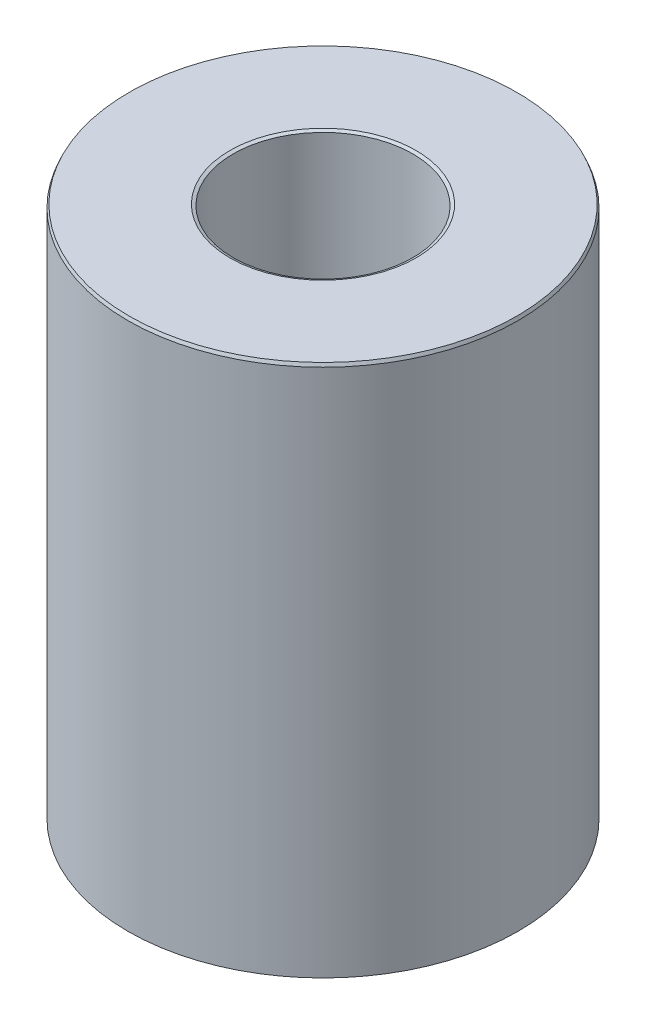
ISO-10303-21;
HEADER;
FILE_DESCRIPTION(('STEP AP214'),'2;1');
FILE_NAME('part.step','',(''),(''),'','','');
FILE_SCHEMA(('AUTOMOTIVE_DESIGN { 1 0 10303 214 1 1 1 1 }'));
ENDSEC;
DATA;
#1=APPLICATION_CONTEXT('core data for automotive mechanical design processes');
#2=APPLICATION_PROTOCOL_DEFINITION('international standard','automotive_design',2000,#1);
#3=PRODUCT_CONTEXT('',#1,'mechanical');
#4=PRODUCT('Part','Part','',(#3));
#5=PRODUCT_RELATED_PRODUCT_CATEGORY('part','',(#4));
#6=PRODUCT_DEFINITION_FORMATION('','',#4);
#7=PRODUCT_DEFINITION_CONTEXT('part definition',#1,'design');
#8=PRODUCT_DEFINITION('design','',#6,#7);
#9=PRODUCT_DEFINITION_SHAPE('','',#8);
#10=(LENGTH_UNIT() NAMED_UNIT(*) SI_UNIT(.MILLI.,.METRE.));
#11=(NAMED_UNIT(*) PLANE_ANGLE_UNIT() SI_UNIT($,.RADIAN.));
#12=(NAMED_UNIT(*) SI_UNIT($,.STERADIAN.) SOLID_ANGLE_UNIT());
#13=UNCERTAINTY_MEASURE_WITH_UNIT(LENGTH_MEASURE(1.E-05),#10,'distance_accuracy_value','');
#14=(GEOMETRIC_REPRESENTATION_CONTEXT(3) GLOBAL_UNCERTAINTY_ASSIGNED_CONTEXT((#13)) GLOBAL_UNIT_ASSIGNED_CONTEXT((#10,
#11,#12)) REPRESENTATION_CONTEXT('',''));
#15=CARTESIAN_POINT('',(0.,0.,0.));
#16=DIRECTION('',(0.,0.,1.));
#17=DIRECTION('',(1.,0.,0.));
#18=AXIS2_PLACEMENT_3D('',#15,#16,#17);
#19=CARTESIAN_POINT('',(0.,109.313836676335,0.));
#20=DIRECTION('',(0.,-1.,0.));
#21=DIRECTION('',(0.,0.,-1.));
#22=AXIS2_PLACEMENT_3D('',#19,#20,#21);
#23=CYLINDRICAL_SURFACE('',#22,40.);
#24=CARTESIAN_POINT('',(0.,0.276940418841298,0.));
#25=DIRECTION('',(0.,1.,0.));
#26=DIRECTION('',(0.,0.,1.));
#27=AXIS2_PLACEMENT_3D('',#24,#25,#26);
#28=CIRCLE('',#27,40.);
#29=CARTESIAN_POINT('',(0.,0.276940418841298,40.));
#30=VERTEX_POINT('',#29);
#31=EDGE_CURVE('E10',#30,#30,#28,.T.);
#32=ORIENTED_EDGE('',*,*,#31,.T.);
#33=EDGE_LOOP('',(#32));
#34=FACE_BOUND('',#33,.T.);
#35=CARTESIAN_POINT('',(0.,108.660381924123,0.));
#36=DIRECTION('',(0.,1.,0.));
#37=DIRECTION('',(0.,0.,1.));
#38=AXIS2_PLACEMENT_3D('',#35,#36,#37);
#39=CIRCLE('',#38,40.);
#40=CARTESIAN_POINT('',(0.,108.660381924123,40.));
#41=VERTEX_POINT('',#40);
#42=EDGE_CURVE('E50',#41,#41,#39,.F.);
#43=ORIENTED_EDGE('',*,*,#42,.T.);
#44=EDGE_LOOP('',(#43));
#45=FACE_BOUND('',#44,.T.);
#46=ADVANCED_FACE('F39',(#34,#45),#23,.T.);
#47=CARTESIAN_POINT('',(0.,109.313836676335,0.));
#48=DIRECTION('',(0.,1.,0.));
#49=DIRECTION('',(0.,0.,1.));
#50=AXIS2_PLACEMENT_3D('',#47,#48,#49);
#51=PLANE('',#50);
#52=CARTESIAN_POINT('',(0.,109.313836676335,0.));
#53=DIRECTION('',(0.,1.,0.));
#54=DIRECTION('',(0.,0.,1.));
#55=AXIS2_PLACEMENT_3D('',#52,#53,#54);
#56=CIRCLE('',#55,19.0755093507502);
#57=CARTESIAN_POINT('',(0.,109.313836676335,19.0755093507502));
#58=VERTEX_POINT('',#57);
#59=EDGE_CURVE('E58',#58,#58,#56,.F.);
#60=ORIENTED_EDGE('',*,*,#59,.T.);
#61=EDGE_LOOP('',(#60));
#62=FACE_BOUND('',#61,.T.);
#63=CARTESIAN_POINT('',(0.,109.313836676335,0.));
#64=DIRECTION('',(0.,1.,0.));
#65=DIRECTION('',(0.,0.,1.));
#66=AXIS2_PLACEMENT_3D('',#63,#64,#65);
#67=CIRCLE('',#66,39.7230595811587);
#68=CARTESIAN_POINT('',(0.,109.313836676335,39.7230595811587));
#69=VERTEX_POINT('',#68);
#70=EDGE_CURVE('E61',#69,#69,#67,.T.);
#71=ORIENTED_EDGE('',*,*,#70,.T.);
#72=EDGE_LOOP('',(#71));
#73=FACE_BOUND('',#72,.T.);
#74=ADVANCED_FACE('F88',(#62,#73),#51,.T.);
#75=CARTESIAN_POINT('',(0.,0.,0.));
#76=DIRECTION('',(0.,1.,0.));
#77=DIRECTION('',(0.,0.,1.));
#78=AXIS2_PLACEMENT_3D('',#75,#76,#77);
#79=PLANE('',#78);
#80=CARTESIAN_POINT('',(0.,0.,0.));
#81=DIRECTION('',(0.,1.,0.));
#82=DIRECTION('',(0.,0.,1.));
#83=AXIS2_PLACEMENT_3D('',#80,#81,#82);
#84=CIRCLE('',#83,18.69899501738);
#85=CARTESIAN_POINT('',(0.,0.,18.69899501738));
#86=VERTEX_POINT('',#85);
#87=EDGE_CURVE('E51',#86,#86,#84,.T.);
#88=ORIENTED_EDGE('',*,*,#87,.T.);
#89=EDGE_LOOP('',(#88));
#90=FACE_BOUND('',#89,.T.);
#91=CARTESIAN_POINT('',(0.,0.,0.));
#92=DIRECTION('',(0.,1.,0.));
#93=DIRECTION('',(0.,0.,1.));
#94=AXIS2_PLACEMENT_3D('',#91,#92,#93);
#95=CIRCLE('',#94,39.3465452477884);
#96=CARTESIAN_POINT('',(0.,0.,39.3465452477884));
#97=VERTEX_POINT('',#96);
#98=EDGE_CURVE('E54',#97,#97,#95,.F.);
#99=ORIENTED_EDGE('',*,*,#98,.T.);
#100=EDGE_LOOP('',(#99));
#101=FACE_BOUND('',#100,.T.);
#102=ADVANCED_FACE('F83',(#90,#101),#79,.F.);
#103=CARTESIAN_POINT('',(0.,109.313836676335,0.));
#104=DIRECTION('',(0.,-1.,0.));
#105=DIRECTION('',(0.,0.,-1.));
#106=AXIS2_PLACEMENT_3D('',#103,#104,#105);
#107=CYLINDRICAL_SURFACE('',#106,18.4220545985387);
#108=CARTESIAN_POINT('',(0.,109.036896257494,0.));
#109=DIRECTION('',(0.,1.,0.));
#110=DIRECTION('',(0.,0.,1.));
#111=AXIS2_PLACEMENT_3D('',#108,#109,#110);
#112=CIRCLE('',#111,18.4220545985387);
#113=CARTESIAN_POINT('',(0.,109.036896257494,18.4220545985387));
#114=VERTEX_POINT('',#113);
#115=EDGE_CURVE('E67',#114,#114,#112,.T.);
#116=ORIENTED_EDGE('',*,*,#115,.T.);
#117=EDGE_LOOP('',(#116));
#118=FACE_BOUND('',#117,.T.);
#119=CARTESIAN_POINT('',(0.,0.653454752211624,0.));
#120=DIRECTION('',(0.,1.,0.));
#121=DIRECTION('',(0.,0.,1.));
#122=AXIS2_PLACEMENT_3D('',#119,#120,#121);
#123=CIRCLE('',#122,18.4220545985387);
#124=CARTESIAN_POINT('',(0.,0.653454752211624,18.4220545985387));
#125=VERTEX_POINT('',#124);
#126=EDGE_CURVE('E69',#125,#125,#123,.F.);
#127=ORIENTED_EDGE('',*,*,#126,.T.);
#128=EDGE_LOOP('',(#127));
#129=FACE_BOUND('',#128,.T.);
#130=ADVANCED_FACE('F71',(#118,#129),#107,.F.);
#131=CARTESIAN_POINT('',(0.,109.036896257494,0.));
#132=DIRECTION('',(0.,1.,0.));
#133=DIRECTION('',(0.,0.,1.));
#134=AXIS2_PLACEMENT_3D('',#131,#132,#133);
#135=CONICAL_SURFACE('',#134,18.4220545985387,1.16993436264059);
#136=ORIENTED_EDGE('',*,*,#59,.F.);
#137=EDGE_LOOP('',(#136));
#138=FACE_BOUND('',#137,.T.);
#139=ORIENTED_EDGE('',*,*,#115,.F.);
#140=EDGE_LOOP('',(#139));
#141=FACE_BOUND('',#140,.T.);
#142=ADVANCED_FACE('F77',(#138,#141),#135,.F.);
#143=CARTESIAN_POINT('',(0.,0.,0.));
#144=DIRECTION('',(0.,-1.,0.));
#145=DIRECTION('',(0.,0.,-1.));
#146=AXIS2_PLACEMENT_3D('',#143,#144,#145);
#147=CONICAL_SURFACE('',#146,18.69899501738,0.40086196415429);
#148=ORIENTED_EDGE('',*,*,#126,.F.);
#149=EDGE_LOOP('',(#148));
#150=FACE_BOUND('',#149,.T.);
#151=ORIENTED_EDGE('',*,*,#87,.F.);
#152=EDGE_LOOP('',(#151));
#153=FACE_BOUND('',#152,.T.);
#154=ADVANCED_FACE('F73',(#150,#153),#147,.F.);
#155=CARTESIAN_POINT('',(0.,0.276940418841298,0.));
#156=DIRECTION('',(0.,1.,0.));
#157=DIRECTION('',(0.,0.,1.));
#158=AXIS2_PLACEMENT_3D('',#155,#156,#157);
#159=CONICAL_SURFACE('',#158,40.,1.16993436264061);
#160=ORIENTED_EDGE('',*,*,#98,.F.);
#161=EDGE_LOOP('',(#160));
#162=FACE_BOUND('',#161,.T.);
#163=ORIENTED_EDGE('',*,*,#31,.F.);
#164=EDGE_LOOP('',(#163));
#165=FACE_BOUND('',#164,.T.);
#166=ADVANCED_FACE('F76',(#162,#165),#159,.T.);
#167=CARTESIAN_POINT('',(0.,109.313836676335,0.));
#168=DIRECTION('',(0.,-1.,0.));
#169=DIRECTION('',(0.,0.,-1.));
#170=AXIS2_PLACEMENT_3D('',#167,#168,#169);
#171=CONICAL_SURFACE('',#170,39.7230595811587,0.400861964154308);
#172=ORIENTED_EDGE('',*,*,#42,.F.);
#173=EDGE_LOOP('',(#172));
#174=FACE_BOUND('',#173,.T.);
#175=ORIENTED_EDGE('',*,*,#70,.F.);
#176=EDGE_LOOP('',(#175));
#177=FACE_BOUND('',#176,.T.);
#178=ADVANCED_FACE('F45',(#174,#177),#171,.T.);
#179=CLOSED_SHELL('',(#46,#74,#102,#130,#142,#154,#166,#178));
#180=MANIFOLD_SOLID_BREP('B2',#179);
#181=ADVANCED_BREP_SHAPE_REPRESENTATION('',(#18,#180),#14);
#182=SHAPE_DEFINITION_REPRESENTATION(#9,#181);
ENDSEC;
END-ISO-10303-21;
